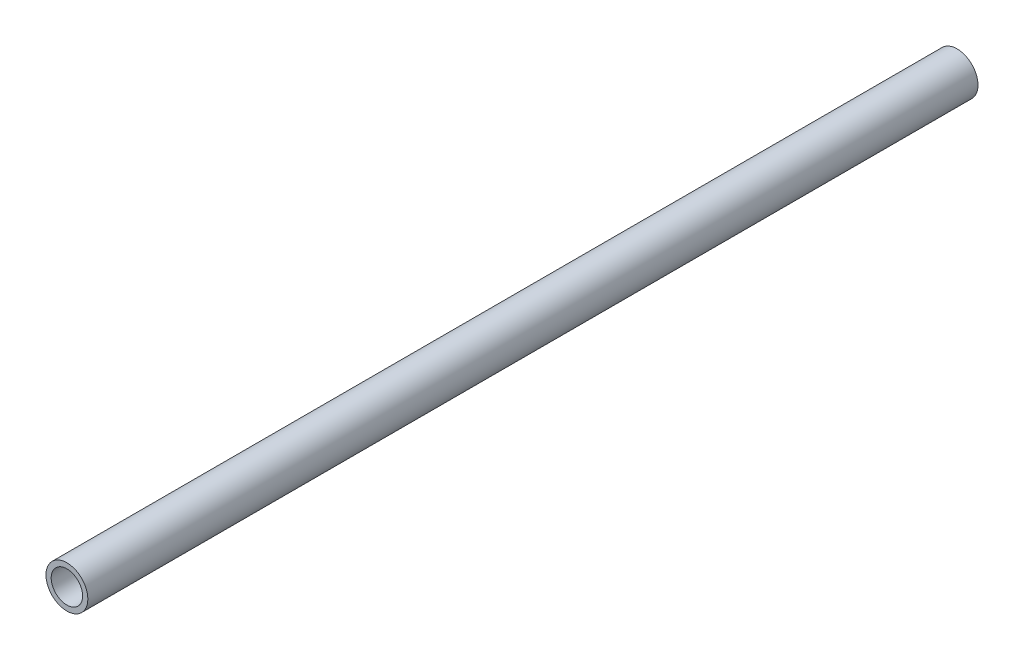
ISO-10303-21;
HEADER;
FILE_DESCRIPTION(('STEP AP214'),'2;1');
FILE_NAME('part.step','',(''),(''),'','','');
FILE_SCHEMA(('AUTOMOTIVE_DESIGN { 1 0 10303 214 1 1 1 1 }'));
ENDSEC;
DATA;
#1=APPLICATION_CONTEXT('core data for automotive mechanical design processes');
#2=APPLICATION_PROTOCOL_DEFINITION('international standard','automotive_design',2000,#1);
#3=PRODUCT_CONTEXT('',#1,'mechanical');
#4=PRODUCT('Part','Part','',(#3));
#5=PRODUCT_RELATED_PRODUCT_CATEGORY('part','',(#4));
#6=PRODUCT_DEFINITION_FORMATION('','',#4);
#7=PRODUCT_DEFINITION_CONTEXT('part definition',#1,'design');
#8=PRODUCT_DEFINITION('design','',#6,#7);
#9=PRODUCT_DEFINITION_SHAPE('','',#8);
#10=(LENGTH_UNIT() NAMED_UNIT(*) SI_UNIT(.MILLI.,.METRE.));
#11=(NAMED_UNIT(*) PLANE_ANGLE_UNIT() SI_UNIT($,.RADIAN.));
#12=(NAMED_UNIT(*) SI_UNIT($,.STERADIAN.) SOLID_ANGLE_UNIT());
#13=UNCERTAINTY_MEASURE_WITH_UNIT(LENGTH_MEASURE(1.E-05),#10,'distance_accuracy_value','');
#14=(GEOMETRIC_REPRESENTATION_CONTEXT(3) GLOBAL_UNCERTAINTY_ASSIGNED_CONTEXT((#13)) GLOBAL_UNIT_ASSIGNED_CONTEXT((#10,
#11,#12)) REPRESENTATION_CONTEXT('',''));
#15=CARTESIAN_POINT('',(0.,0.,0.));
#16=DIRECTION('',(0.,0.,1.));
#17=DIRECTION('',(1.,0.,0.));
#18=AXIS2_PLACEMENT_3D('',#15,#16,#17);
#19=CARTESIAN_POINT('',(0.,0.,457.2));
#20=DIRECTION('',(0.,0.,-1.));
#21=DIRECTION('',(-1.,0.,0.));
#22=AXIS2_PLACEMENT_3D('',#19,#20,#21);
#23=CYLINDRICAL_SURFACE('',#22,12.7);
#24=CARTESIAN_POINT('',(0.,0.,-457.2));
#25=DIRECTION('',(0.,0.,1.));
#26=DIRECTION('',(1.,0.,0.));
#27=AXIS2_PLACEMENT_3D('',#24,#25,#26);
#28=CIRCLE('',#27,12.7);
#29=CARTESIAN_POINT('',(12.7,0.,-457.2));
#30=VERTEX_POINT('',#29);
#31=EDGE_CURVE('E10',#30,#30,#28,.T.);
#32=ORIENTED_EDGE('',*,*,#31,.T.);
#33=EDGE_LOOP('',(#32));
#34=FACE_BOUND('',#33,.T.);
#35=CARTESIAN_POINT('',(0.,0.,82.800000008));
#36=DIRECTION('',(0.,0.,1.));
#37=DIRECTION('',(1.,0.,0.));
#38=AXIS2_PLACEMENT_3D('',#35,#36,#37);
#39=CIRCLE('',#38,12.7);
#40=CARTESIAN_POINT('',(12.7,0.,82.800000008));
#41=VERTEX_POINT('',#40);
#42=EDGE_CURVE('E56',#41,#41,#39,.T.);
#43=ORIENTED_EDGE('',*,*,#42,.F.);
#44=EDGE_LOOP('',(#43));
#45=FACE_BOUND('',#44,.T.);
#46=ADVANCED_FACE('F41',(#34,#45),#23,.T.);
#47=CARTESIAN_POINT('',(0.,0.,457.2));
#48=DIRECTION('',(0.,0.,-1.));
#49=DIRECTION('',(-1.,0.,0.));
#50=AXIS2_PLACEMENT_3D('',#47,#48,#49);
#51=CYLINDRICAL_SURFACE('',#50,9.525);
#52=CARTESIAN_POINT('',(0.,0.,-457.2));
#53=DIRECTION('',(0.,0.,1.));
#54=DIRECTION('',(1.,0.,0.));
#55=AXIS2_PLACEMENT_3D('',#52,#53,#54);
#56=CIRCLE('',#55,9.525);
#57=CARTESIAN_POINT('',(9.525,0.,-457.2));
#58=VERTEX_POINT('',#57);
#59=EDGE_CURVE('E49',#58,#58,#56,.T.);
#60=ORIENTED_EDGE('',*,*,#59,.F.);
#61=EDGE_LOOP('',(#60));
#62=FACE_BOUND('',#61,.T.);
#63=CARTESIAN_POINT('',(0.,0.,82.800000008));
#64=DIRECTION('',(0.,0.,1.));
#65=DIRECTION('',(1.,0.,0.));
#66=AXIS2_PLACEMENT_3D('',#63,#64,#65);
#67=CIRCLE('',#66,9.525);
#68=CARTESIAN_POINT('',(9.525,0.,82.800000008));
#69=VERTEX_POINT('',#68);
#70=EDGE_CURVE('E44',#69,#69,#67,.T.);
#71=ORIENTED_EDGE('',*,*,#70,.T.);
#72=EDGE_LOOP('',(#71));
#73=FACE_BOUND('',#72,.T.);
#74=ADVANCED_FACE('F65',(#62,#73),#51,.F.);
#75=CARTESIAN_POINT('',(0.,0.,-457.2));
#76=DIRECTION('',(0.,0.,1.));
#77=DIRECTION('',(1.,0.,0.));
#78=AXIS2_PLACEMENT_3D('',#75,#76,#77);
#79=PLANE('',#78);
#80=ORIENTED_EDGE('',*,*,#59,.T.);
#81=EDGE_LOOP('',(#80));
#82=FACE_BOUND('',#81,.T.);
#83=ORIENTED_EDGE('',*,*,#31,.F.);
#84=EDGE_LOOP('',(#83));
#85=FACE_BOUND('',#84,.T.);
#86=ADVANCED_FACE('F69',(#82,#85),#79,.F.);
#87=CARTESIAN_POINT('',(0.,0.,82.800000008));
#88=DIRECTION('',(0.,0.,1.));
#89=DIRECTION('',(1.,0.,0.));
#90=AXIS2_PLACEMENT_3D('',#87,#88,#89);
#91=PLANE('',#90);
#92=ORIENTED_EDGE('',*,*,#70,.F.);
#93=EDGE_LOOP('',(#92));
#94=FACE_BOUND('',#93,.T.);
#95=ORIENTED_EDGE('',*,*,#42,.T.);
#96=EDGE_LOOP('',(#95));
#97=FACE_BOUND('',#96,.T.);
#98=ADVANCED_FACE('F67',(#94,#97),#91,.T.);
#99=CLOSED_SHELL('',(#46,#74,#86,#98));
#100=MANIFOLD_SOLID_BREP('B2',#99);
#101=ADVANCED_BREP_SHAPE_REPRESENTATION('',(#18,#100),#14);
#102=SHAPE_DEFINITION_REPRESENTATION(#9,#101);
ENDSEC;
END-ISO-10303-21;
